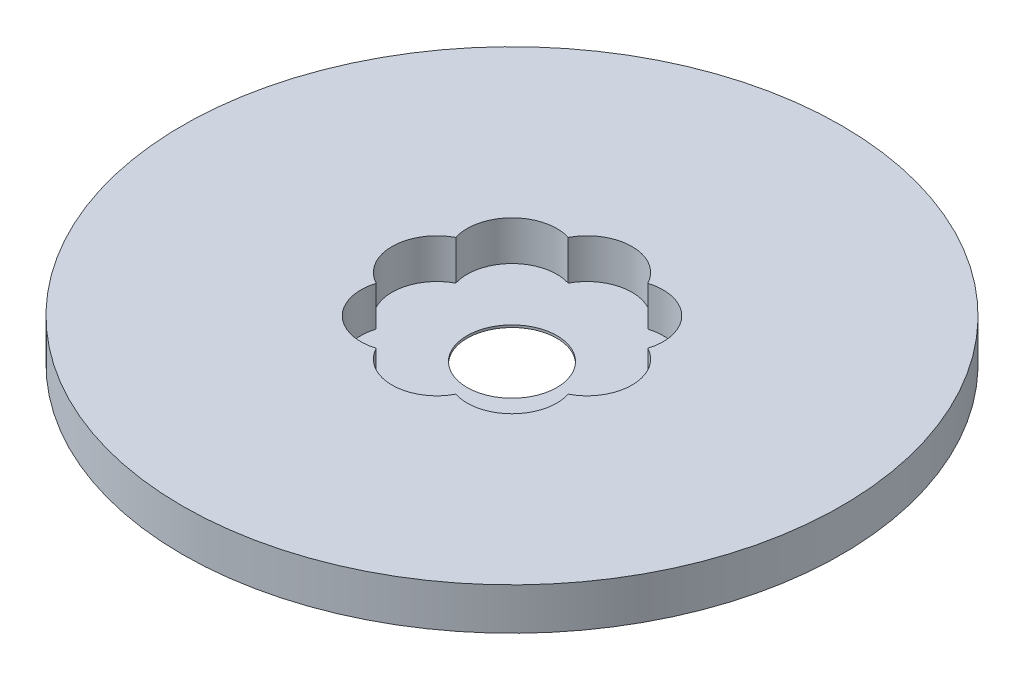
ISO-10303-21;
HEADER;
FILE_DESCRIPTION(('STEP AP214'),'2;1');
FILE_NAME('part.step','',(''),(''),'','','');
FILE_SCHEMA(('AUTOMOTIVE_DESIGN { 1 0 10303 214 1 1 1 1 }'));
ENDSEC;
DATA;
#1=APPLICATION_CONTEXT('core data for automotive mechanical design processes');
#2=APPLICATION_PROTOCOL_DEFINITION('international standard','automotive_design',2000,#1);
#3=PRODUCT_CONTEXT('',#1,'mechanical');
#4=PRODUCT('Part','Part','',(#3));
#5=PRODUCT_RELATED_PRODUCT_CATEGORY('part','',(#4));
#6=PRODUCT_DEFINITION_FORMATION('','',#4);
#7=PRODUCT_DEFINITION_CONTEXT('part definition',#1,'design');
#8=PRODUCT_DEFINITION('design','',#6,#7);
#9=PRODUCT_DEFINITION_SHAPE('','',#8);
#10=(LENGTH_UNIT() NAMED_UNIT(*) SI_UNIT(.MILLI.,.METRE.));
#11=(NAMED_UNIT(*) PLANE_ANGLE_UNIT() SI_UNIT($,.RADIAN.));
#12=(NAMED_UNIT(*) SI_UNIT($,.STERADIAN.) SOLID_ANGLE_UNIT());
#13=UNCERTAINTY_MEASURE_WITH_UNIT(LENGTH_MEASURE(1.E-05),#10,'distance_accuracy_value','');
#14=(GEOMETRIC_REPRESENTATION_CONTEXT(3) GLOBAL_UNCERTAINTY_ASSIGNED_CONTEXT((#13)) GLOBAL_UNIT_ASSIGNED_CONTEXT((#10,
#11,#12)) REPRESENTATION_CONTEXT('',''));
#15=CARTESIAN_POINT('',(0.,0.,0.));
#16=DIRECTION('',(0.,0.,1.));
#17=DIRECTION('',(1.,0.,0.));
#18=AXIS2_PLACEMENT_3D('',#15,#16,#17);
#19=CARTESIAN_POINT('',(0.,7.,0.));
#20=DIRECTION('',(0.,-1.,0.));
#21=DIRECTION('',(0.,0.,-1.));
#22=AXIS2_PLACEMENT_3D('',#19,#20,#21);
#23=CYLINDRICAL_SURFACE('',#22,7.5);
#24=CARTESIAN_POINT('',(0.,0.,0.));
#25=DIRECTION('',(0.,1.,0.));
#26=DIRECTION('',(0.,0.,1.));
#27=AXIS2_PLACEMENT_3D('',#24,#25,#26);
#28=CIRCLE('',#27,7.5);
#29=CARTESIAN_POINT('',(0.,0.,7.5));
#30=VERTEX_POINT('',#29);
#31=EDGE_CURVE('E166',#30,#30,#28,.T.);
#32=ORIENTED_EDGE('',*,*,#31,.F.);
#33=EDGE_LOOP('',(#32));
#34=FACE_BOUND('',#33,.T.);
#35=CARTESIAN_POINT('',(0.,0.386239491260389,0.));
#36=DIRECTION('',(0.,1.,0.));
#37=DIRECTION('',(0.,0.,1.));
#38=AXIS2_PLACEMENT_3D('',#35,#36,#37);
#39=CIRCLE('',#38,7.5);
#40=CARTESIAN_POINT('',(0.,0.386239491260389,7.5));
#41=VERTEX_POINT('',#40);
#42=EDGE_CURVE('E11',#41,#41,#39,.T.);
#43=ORIENTED_EDGE('',*,*,#42,.T.);
#44=EDGE_LOOP('',(#43));
#45=FACE_BOUND('',#44,.T.);
#46=ADVANCED_FACE('F39',(#34,#45),#23,.F.);
#47=CARTESIAN_POINT('',(0.,7.,0.));
#48=DIRECTION('',(0.,-1.,0.));
#49=DIRECTION('',(0.,0.,-1.));
#50=AXIS2_PLACEMENT_3D('',#47,#48,#49);
#51=CYLINDRICAL_SURFACE('',#50,55.);
#52=CARTESIAN_POINT('',(0.,7.,0.));
#53=DIRECTION('',(0.,1.,0.));
#54=DIRECTION('',(0.,0.,1.));
#55=AXIS2_PLACEMENT_3D('',#52,#53,#54);
#56=CIRCLE('',#55,55.);
#57=CARTESIAN_POINT('',(0.,7.,55.));
#58=VERTEX_POINT('',#57);
#59=EDGE_CURVE('E50',#58,#58,#56,.T.);
#60=ORIENTED_EDGE('',*,*,#59,.F.);
#61=EDGE_LOOP('',(#60));
#62=FACE_BOUND('',#61,.T.);
#63=CARTESIAN_POINT('',(0.,0.,0.));
#64=DIRECTION('',(0.,1.,0.));
#65=DIRECTION('',(0.,0.,1.));
#66=AXIS2_PLACEMENT_3D('',#63,#64,#65);
#67=CIRCLE('',#66,55.);
#68=CARTESIAN_POINT('',(0.,0.,55.));
#69=VERTEX_POINT('',#68);
#70=EDGE_CURVE('E173',#69,#69,#67,.T.);
#71=ORIENTED_EDGE('',*,*,#70,.T.);
#72=EDGE_LOOP('',(#71));
#73=FACE_BOUND('',#72,.T.);
#74=ADVANCED_FACE('F41',(#62,#73),#51,.T.);
#75=CARTESIAN_POINT('',(0.,7.,0.));
#76=DIRECTION('',(0.,1.,0.));
#77=DIRECTION('',(0.,0.,1.));
#78=AXIS2_PLACEMENT_3D('',#75,#76,#77);
#79=PLANE('',#78);
#80=CARTESIAN_POINT('',(-8.86275346567437,7.,8.8627534656744));
#81=DIRECTION('',(0.,1.,0.));
#82=DIRECTION('',(0.707106781186549,0.,0.707106781186546));
#83=AXIS2_PLACEMENT_3D('',#80,#81,#82);
#84=CIRCLE('',#83,7.49842630389843);
#85=CARTESIAN_POINT('',(-16.0232435247937,7.,6.63704478117643));
#86=VERTEX_POINT('',#85);
#87=CARTESIAN_POINT('',(-6.63704478117637,7.,16.0232435247937));
#88=VERTEX_POINT('',#87);
#89=EDGE_CURVE('E159',#86,#88,#84,.T.);
#90=ORIENTED_EDGE('',*,*,#89,.F.);
#91=CARTESIAN_POINT('',(-12.5338261511259,7.,0.));
#92=DIRECTION('',(0.,1.,0.));
#93=DIRECTION('',(0.,0.,1.));
#94=AXIS2_PLACEMENT_3D('',#91,#92,#93);
#95=CIRCLE('',#94,7.49842630389843);
#96=CARTESIAN_POINT('',(-16.0232435247938,7.,-6.63704478117636));
#97=VERTEX_POINT('',#96);
#98=EDGE_CURVE('E167',#97,#86,#95,.T.);
#99=ORIENTED_EDGE('',*,*,#98,.F.);
#100=CARTESIAN_POINT('',(-8.86275346567449,7.,-8.86275346567428));
#101=DIRECTION('',(0.,1.,0.));
#102=DIRECTION('',(-0.707106781186539,0.,0.707106781186556));
#103=AXIS2_PLACEMENT_3D('',#100,#101,#102);
#104=CIRCLE('',#103,7.49842630389843);
#105=CARTESIAN_POINT('',(-6.6370447811766,7.,-16.0232435247936));
#106=VERTEX_POINT('',#105);
#107=EDGE_CURVE('E53',#106,#97,#104,.T.);
#108=ORIENTED_EDGE('',*,*,#107,.F.);
#109=CARTESIAN_POINT('',(-1.3128486033288E-13,7.,-12.5338261511259));
#110=DIRECTION('',(0.,1.,0.));
#111=DIRECTION('',(-1.,0.,0.));
#112=AXIS2_PLACEMENT_3D('',#109,#110,#111);
#113=CIRCLE('',#112,7.49842630389843);
#114=CARTESIAN_POINT('',(6.63704478117626,7.,-16.0232435247937));
#115=VERTEX_POINT('',#114);
#116=EDGE_CURVE('E117',#115,#106,#113,.T.);
#117=ORIENTED_EDGE('',*,*,#116,.F.);
#118=CARTESIAN_POINT('',(8.86275346567431,7.,-8.86275346567446));
#119=DIRECTION('',(0.,1.,0.));
#120=DIRECTION('',(-0.707106781186554,0.,-0.707106781186541));
#121=AXIS2_PLACEMENT_3D('',#118,#119,#120);
#122=CIRCLE('',#121,7.49842630389843);
#123=CARTESIAN_POINT('',(16.0232435247936,7.,-6.63704478117646));
#124=VERTEX_POINT('',#123);
#125=EDGE_CURVE('E120',#124,#115,#122,.T.);
#126=ORIENTED_EDGE('',*,*,#125,.F.);
#127=CARTESIAN_POINT('',(12.5338261511259,7.,0.));
#128=DIRECTION('',(0.,1.,0.));
#129=DIRECTION('',(0.,0.,-1.));
#130=AXIS2_PLACEMENT_3D('',#127,#128,#129);
#131=CIRCLE('',#130,7.49842630389843);
#132=CARTESIAN_POINT('',(16.0232435247937,7.,6.63704478117639));
#133=VERTEX_POINT('',#132);
#134=EDGE_CURVE('E136',#133,#124,#131,.T.);
#135=ORIENTED_EDGE('',*,*,#134,.F.);
#136=CARTESIAN_POINT('',(8.86275346567443,7.,8.86275346567434));
#137=DIRECTION('',(0.,1.,0.));
#138=DIRECTION('',(0.707106781186544,0.,-0.707106781186551));
#139=AXIS2_PLACEMENT_3D('',#136,#137,#138);
#140=CIRCLE('',#139,7.49842630389843);
#141=CARTESIAN_POINT('',(6.63704478117648,7.,16.0232435247936));
#142=VERTEX_POINT('',#141);
#143=EDGE_CURVE('E138',#142,#133,#140,.T.);
#144=ORIENTED_EDGE('',*,*,#143,.F.);
#145=CARTESIAN_POINT('',(0.,7.,12.5338261511259));
#146=DIRECTION('',(0.,1.,0.));
#147=DIRECTION('',(1.,0.,0.));
#148=AXIS2_PLACEMENT_3D('',#145,#146,#147);
#149=CIRCLE('',#148,7.49842630389843);
#150=EDGE_CURVE('E146',#88,#142,#149,.T.);
#151=ORIENTED_EDGE('',*,*,#150,.F.);
#152=EDGE_LOOP('',(#90,#99,#108,#117,#126,#135,#144,#151));
#153=FACE_BOUND('',#152,.T.);
#154=ORIENTED_EDGE('',*,*,#59,.T.);
#155=EDGE_LOOP('',(#154));
#156=FACE_BOUND('',#155,.T.);
#157=ADVANCED_FACE('F181',(#153,#156),#79,.T.);
#158=CARTESIAN_POINT('',(0.,0.,0.));
#159=DIRECTION('',(0.,1.,0.));
#160=DIRECTION('',(0.,0.,1.));
#161=AXIS2_PLACEMENT_3D('',#158,#159,#160);
#162=PLANE('',#161);
#163=ORIENTED_EDGE('',*,*,#31,.T.);
#164=EDGE_LOOP('',(#163));
#165=FACE_BOUND('',#164,.T.);
#166=ORIENTED_EDGE('',*,*,#70,.F.);
#167=EDGE_LOOP('',(#166));
#168=FACE_BOUND('',#167,.T.);
#169=ADVANCED_FACE('F179',(#165,#168),#162,.F.);
#170=CARTESIAN_POINT('',(-12.5338261511259,0.386239491260389,0.));
#171=DIRECTION('',(0.,1.,0.));
#172=DIRECTION('',(0.,0.,1.));
#173=AXIS2_PLACEMENT_3D('',#170,#171,#172);
#174=CYLINDRICAL_SURFACE('',#173,7.49842630389843);
#175=ORIENTED_EDGE('',*,*,#98,.T.);
#176=DIRECTION('',(0.,1.,0.));
#177=VECTOR('',#176,1.);
#178=CARTESIAN_POINT('',(-16.0232435247937,3.69311974563019,6.63704478117643));
#179=LINE('',#178,#177);
#180=CARTESIAN_POINT('',(-16.0232435247937,0.386239491260389,6.63704478117643));
#181=VERTEX_POINT('',#180);
#182=EDGE_CURVE('E65',#86,#181,#179,.F.);
#183=ORIENTED_EDGE('',*,*,#182,.T.);
#184=CARTESIAN_POINT('',(-12.5338261511259,0.386239491260389,0.));
#185=DIRECTION('',(0.,1.,0.));
#186=DIRECTION('',(0.,0.,1.));
#187=AXIS2_PLACEMENT_3D('',#184,#185,#186);
#188=CIRCLE('',#187,7.49842630389843);
#189=CARTESIAN_POINT('',(-16.0232435247938,0.386239491260389,-6.63704478117635));
#190=VERTEX_POINT('',#189);
#191=EDGE_CURVE('E170',#190,#181,#188,.T.);
#192=ORIENTED_EDGE('',*,*,#191,.F.);
#193=DIRECTION('',(0.,1.,0.));
#194=VECTOR('',#193,1.);
#195=CARTESIAN_POINT('',(-16.0232435247938,3.69311974563019,-6.63704478117635));
#196=LINE('',#195,#194);
#197=EDGE_CURVE('E124',#190,#97,#196,.T.);
#198=ORIENTED_EDGE('',*,*,#197,.T.);
#199=EDGE_LOOP('',(#175,#183,#192,#198));
#200=FACE_BOUND('',#199,.T.);
#201=ADVANCED_FACE('F185',(#200),#174,.F.);
#202=CARTESIAN_POINT('',(-12.5338261511259,0.386239491260389,0.));
#203=DIRECTION('',(0.,1.,0.));
#204=DIRECTION('',(0.,0.,1.));
#205=AXIS2_PLACEMENT_3D('',#202,#203,#204);
#206=PLANE('',#205);
#207=ORIENTED_EDGE('',*,*,#191,.T.);
#208=CARTESIAN_POINT('',(-8.86275346567437,0.386239491260389,8.8627534656744));
#209=DIRECTION('',(0.,1.,0.));
#210=DIRECTION('',(0.707106781186549,0.,0.707106781186546));
#211=AXIS2_PLACEMENT_3D('',#208,#209,#210);
#212=CIRCLE('',#211,7.49842630389843);
#213=CARTESIAN_POINT('',(-6.63704478117637,0.386239491260389,16.0232435247937));
#214=VERTEX_POINT('',#213);
#215=EDGE_CURVE('E161',#181,#214,#212,.T.);
#216=ORIENTED_EDGE('',*,*,#215,.T.);
#217=CARTESIAN_POINT('',(0.,0.386239491260389,12.5338261511259));
#218=DIRECTION('',(0.,1.,0.));
#219=DIRECTION('',(1.,0.,0.));
#220=AXIS2_PLACEMENT_3D('',#217,#218,#219);
#221=CIRCLE('',#220,7.49842630389843);
#222=CARTESIAN_POINT('',(6.63704478117648,0.386239491260389,16.0232435247936));
#223=VERTEX_POINT('',#222);
#224=EDGE_CURVE('E149',#214,#223,#221,.T.);
#225=ORIENTED_EDGE('',*,*,#224,.T.);
#226=CARTESIAN_POINT('',(8.86275346567443,0.386239491260389,8.86275346567434));
#227=DIRECTION('',(0.,1.,0.));
#228=DIRECTION('',(0.707106781186544,0.,-0.707106781186551));
#229=AXIS2_PLACEMENT_3D('',#226,#227,#228);
#230=CIRCLE('',#229,7.49842630389843);
#231=CARTESIAN_POINT('',(16.0232435247937,0.386239491260389,6.63704478117639));
#232=VERTEX_POINT('',#231);
#233=EDGE_CURVE('E143',#223,#232,#230,.T.);
#234=ORIENTED_EDGE('',*,*,#233,.T.);
#235=CARTESIAN_POINT('',(12.5338261511259,0.386239491260389,0.));
#236=DIRECTION('',(0.,1.,0.));
#237=DIRECTION('',(0.,0.,-1.));
#238=AXIS2_PLACEMENT_3D('',#235,#236,#237);
#239=CIRCLE('',#238,7.49842630389843);
#240=CARTESIAN_POINT('',(16.0232435247936,0.386239491260389,-6.63704478117646));
#241=VERTEX_POINT('',#240);
#242=EDGE_CURVE('E140',#232,#241,#239,.T.);
#243=ORIENTED_EDGE('',*,*,#242,.T.);
#244=CARTESIAN_POINT('',(8.86275346567431,0.386239491260389,-8.86275346567446));
#245=DIRECTION('',(0.,1.,0.));
#246=DIRECTION('',(-0.707106781186554,0.,-0.707106781186541));
#247=AXIS2_PLACEMENT_3D('',#244,#245,#246);
#248=CIRCLE('',#247,7.49842630389843);
#249=CARTESIAN_POINT('',(6.63704478117626,0.386239491260389,-16.0232435247937));
#250=VERTEX_POINT('',#249);
#251=EDGE_CURVE('E111',#241,#250,#248,.T.);
#252=ORIENTED_EDGE('',*,*,#251,.T.);
#253=CARTESIAN_POINT('',(-1.3128486033288E-13,0.386239491260389,-12.5338261511259));
#254=DIRECTION('',(0.,1.,0.));
#255=DIRECTION('',(-1.,0.,0.));
#256=AXIS2_PLACEMENT_3D('',#253,#254,#255);
#257=CIRCLE('',#256,7.49842630389843);
#258=CARTESIAN_POINT('',(-6.6370447811766,0.386239491260389,-16.0232435247936));
#259=VERTEX_POINT('',#258);
#260=EDGE_CURVE('E104',#250,#259,#257,.T.);
#261=ORIENTED_EDGE('',*,*,#260,.T.);
#262=CARTESIAN_POINT('',(-8.86275346567449,0.386239491260389,-8.86275346567428));
#263=DIRECTION('',(0.,1.,0.));
#264=DIRECTION('',(-0.707106781186539,0.,0.707106781186556));
#265=AXIS2_PLACEMENT_3D('',#262,#263,#264);
#266=CIRCLE('',#265,7.49842630389843);
#267=EDGE_CURVE('E112',#259,#190,#266,.T.);
#268=ORIENTED_EDGE('',*,*,#267,.T.);
#269=EDGE_LOOP('',(#207,#216,#225,#234,#243,#252,#261,#268));
#270=FACE_BOUND('',#269,.T.);
#271=ORIENTED_EDGE('',*,*,#42,.F.);
#272=EDGE_LOOP('',(#271));
#273=FACE_BOUND('',#272,.T.);
#274=ADVANCED_FACE('F107',(#270,#273),#206,.T.);
#275=CARTESIAN_POINT('',(-8.86275346567437,0.386239491260389,8.8627534656744));
#276=DIRECTION('',(0.,1.,0.));
#277=DIRECTION('',(0.,0.,1.));
#278=AXIS2_PLACEMENT_3D('',#275,#276,#277);
#279=CYLINDRICAL_SURFACE('',#278,7.49842630389843);
#280=ORIENTED_EDGE('',*,*,#89,.T.);
#281=DIRECTION('',(0.,1.,0.));
#282=VECTOR('',#281,1.);
#283=CARTESIAN_POINT('',(-6.63704478117637,3.69311974563019,16.0232435247937));
#284=LINE('',#283,#282);
#285=EDGE_CURVE('E160',#88,#214,#284,.F.);
#286=ORIENTED_EDGE('',*,*,#285,.T.);
#287=ORIENTED_EDGE('',*,*,#215,.F.);
#288=ORIENTED_EDGE('',*,*,#182,.F.);
#289=EDGE_LOOP('',(#280,#286,#287,#288));
#290=FACE_BOUND('',#289,.T.);
#291=ADVANCED_FACE('F202',(#290),#279,.F.);
#292=CARTESIAN_POINT('',(-8.86275346567449,0.386239491260389,-8.86275346567428));
#293=DIRECTION('',(0.,1.,0.));
#294=DIRECTION('',(0.,0.,1.));
#295=AXIS2_PLACEMENT_3D('',#292,#293,#294);
#296=CYLINDRICAL_SURFACE('',#295,7.49842630389843);
#297=ORIENTED_EDGE('',*,*,#267,.F.);
#298=DIRECTION('',(0.,1.,0.));
#299=VECTOR('',#298,1.);
#300=CARTESIAN_POINT('',(-6.6370447811766,3.69311974563019,-16.0232435247936));
#301=LINE('',#300,#299);
#302=EDGE_CURVE('E119',#106,#259,#301,.F.);
#303=ORIENTED_EDGE('',*,*,#302,.F.);
#304=ORIENTED_EDGE('',*,*,#107,.T.);
#305=ORIENTED_EDGE('',*,*,#197,.F.);
#306=EDGE_LOOP('',(#297,#303,#304,#305));
#307=FACE_BOUND('',#306,.T.);
#308=ADVANCED_FACE('F123',(#307),#296,.F.);
#309=CARTESIAN_POINT('',(0.,0.386239491260389,12.5338261511259));
#310=DIRECTION('',(0.,1.,0.));
#311=DIRECTION('',(0.,0.,1.));
#312=AXIS2_PLACEMENT_3D('',#309,#310,#311);
#313=CYLINDRICAL_SURFACE('',#312,7.49842630389843);
#314=ORIENTED_EDGE('',*,*,#150,.T.);
#315=DIRECTION('',(0.,1.,0.));
#316=VECTOR('',#315,1.);
#317=CARTESIAN_POINT('',(6.63704478117648,3.69311974563019,16.0232435247936));
#318=LINE('',#317,#316);
#319=EDGE_CURVE('E141',#142,#223,#318,.F.);
#320=ORIENTED_EDGE('',*,*,#319,.T.);
#321=ORIENTED_EDGE('',*,*,#224,.F.);
#322=ORIENTED_EDGE('',*,*,#285,.F.);
#323=EDGE_LOOP('',(#314,#320,#321,#322));
#324=FACE_BOUND('',#323,.T.);
#325=ADVANCED_FACE('F208',(#324),#313,.F.);
#326=CARTESIAN_POINT('',(8.86275346567443,0.386239491260389,8.86275346567434));
#327=DIRECTION('',(0.,1.,0.));
#328=DIRECTION('',(0.,0.,1.));
#329=AXIS2_PLACEMENT_3D('',#326,#327,#328);
#330=CYLINDRICAL_SURFACE('',#329,7.49842630389843);
#331=DIRECTION('',(0.,1.,0.));
#332=VECTOR('',#331,1.);
#333=CARTESIAN_POINT('',(16.0232435247937,3.69311974563019,6.63704478117639));
#334=LINE('',#333,#332);
#335=EDGE_CURVE('E151',#133,#232,#334,.F.);
#336=ORIENTED_EDGE('',*,*,#335,.T.);
#337=ORIENTED_EDGE('',*,*,#233,.F.);
#338=ORIENTED_EDGE('',*,*,#319,.F.);
#339=ORIENTED_EDGE('',*,*,#143,.T.);
#340=EDGE_LOOP('',(#336,#337,#338,#339));
#341=FACE_BOUND('',#340,.T.);
#342=ADVANCED_FACE('F211',(#341),#330,.F.);
#343=CARTESIAN_POINT('',(12.5338261511259,0.386239491260389,0.));
#344=DIRECTION('',(0.,1.,0.));
#345=DIRECTION('',(0.,0.,1.));
#346=AXIS2_PLACEMENT_3D('',#343,#344,#345);
#347=CYLINDRICAL_SURFACE('',#346,7.49842630389843);
#348=ORIENTED_EDGE('',*,*,#134,.T.);
#349=DIRECTION('',(0.,1.,0.));
#350=VECTOR('',#349,1.);
#351=CARTESIAN_POINT('',(16.0232435247936,3.69311974563019,-6.63704478117646));
#352=LINE('',#351,#350);
#353=EDGE_CURVE('E131',#124,#241,#352,.F.);
#354=ORIENTED_EDGE('',*,*,#353,.T.);
#355=ORIENTED_EDGE('',*,*,#242,.F.);
#356=ORIENTED_EDGE('',*,*,#335,.F.);
#357=EDGE_LOOP('',(#348,#354,#355,#356));
#358=FACE_BOUND('',#357,.T.);
#359=ADVANCED_FACE('F214',(#358),#347,.F.);
#360=CARTESIAN_POINT('',(8.86275346567431,0.386239491260389,-8.86275346567446));
#361=DIRECTION('',(0.,1.,0.));
#362=DIRECTION('',(0.,0.,1.));
#363=AXIS2_PLACEMENT_3D('',#360,#361,#362);
#364=CYLINDRICAL_SURFACE('',#363,7.49842630389843);
#365=DIRECTION('',(0.,1.,0.));
#366=VECTOR('',#365,1.);
#367=CARTESIAN_POINT('',(6.63704478117626,3.69311974563019,-16.0232435247937));
#368=LINE('',#367,#366);
#369=EDGE_CURVE('E154',#115,#250,#368,.F.);
#370=ORIENTED_EDGE('',*,*,#369,.T.);
#371=ORIENTED_EDGE('',*,*,#251,.F.);
#372=ORIENTED_EDGE('',*,*,#353,.F.);
#373=ORIENTED_EDGE('',*,*,#125,.T.);
#374=EDGE_LOOP('',(#370,#371,#372,#373));
#375=FACE_BOUND('',#374,.T.);
#376=ADVANCED_FACE('F218',(#375),#364,.F.);
#377=CARTESIAN_POINT('',(-1.3128486033288E-13,0.386239491260389,-12.5338261511259));
#378=DIRECTION('',(0.,1.,0.));
#379=DIRECTION('',(0.,0.,1.));
#380=AXIS2_PLACEMENT_3D('',#377,#378,#379);
#381=CYLINDRICAL_SURFACE('',#380,7.49842630389843);
#382=ORIENTED_EDGE('',*,*,#116,.T.);
#383=ORIENTED_EDGE('',*,*,#302,.T.);
#384=ORIENTED_EDGE('',*,*,#260,.F.);
#385=ORIENTED_EDGE('',*,*,#369,.F.);
#386=EDGE_LOOP('',(#382,#383,#384,#385));
#387=FACE_BOUND('',#386,.T.);
#388=ADVANCED_FACE('F121',(#387),#381,.F.);
#389=CLOSED_SHELL('',(#46,#74,#157,#169,#201,#274,#291,#308,#325,#342,#359,#376,#388));
#390=MANIFOLD_SOLID_BREP('B2',#389);
#391=ADVANCED_BREP_SHAPE_REPRESENTATION('',(#18,#390),#14);
#392=SHAPE_DEFINITION_REPRESENTATION(#9,#391);
ENDSEC;
END-ISO-10303-21;
